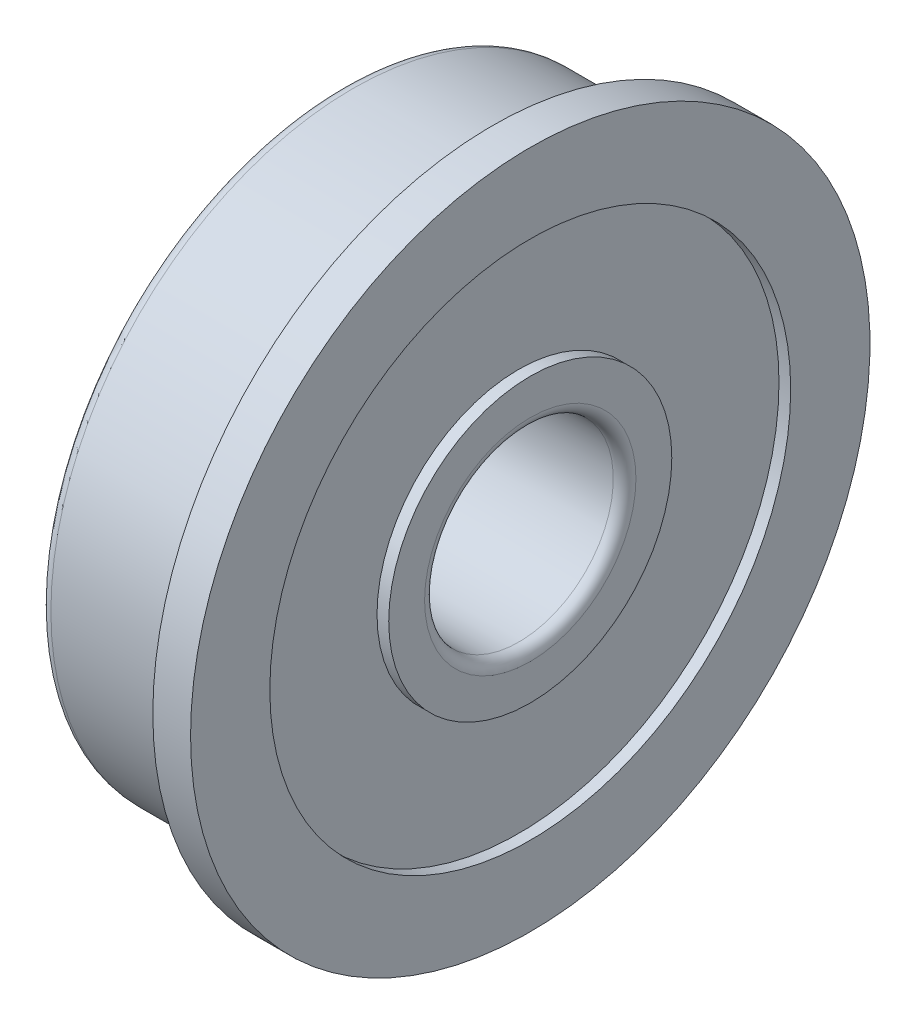
ISO-10303-21;
HEADER;
FILE_DESCRIPTION(('STEP AP214'),'2;1');
FILE_NAME('part.step','',(''),(''),'','','');
FILE_SCHEMA(('AUTOMOTIVE_DESIGN { 1 0 10303 214 1 1 1 1 }'));
ENDSEC;
DATA;
#1=APPLICATION_CONTEXT('core data for automotive mechanical design processes');
#2=APPLICATION_PROTOCOL_DEFINITION('international standard','automotive_design',2000,#1);
#3=PRODUCT_CONTEXT('',#1,'mechanical');
#4=PRODUCT('Part','Part','',(#3));
#5=PRODUCT_RELATED_PRODUCT_CATEGORY('part','',(#4));
#6=PRODUCT_DEFINITION_FORMATION('','',#4);
#7=PRODUCT_DEFINITION_CONTEXT('part definition',#1,'design');
#8=PRODUCT_DEFINITION('design','',#6,#7);
#9=PRODUCT_DEFINITION_SHAPE('','',#8);
#10=(LENGTH_UNIT() NAMED_UNIT(*) SI_UNIT(.MILLI.,.METRE.));
#11=(NAMED_UNIT(*) PLANE_ANGLE_UNIT() SI_UNIT($,.RADIAN.));
#12=(NAMED_UNIT(*) SI_UNIT($,.STERADIAN.) SOLID_ANGLE_UNIT());
#13=UNCERTAINTY_MEASURE_WITH_UNIT(LENGTH_MEASURE(1.E-05),#10,'distance_accuracy_value','');
#14=(GEOMETRIC_REPRESENTATION_CONTEXT(3) GLOBAL_UNCERTAINTY_ASSIGNED_CONTEXT((#13)) GLOBAL_UNIT_ASSIGNED_CONTEXT((#10,
#11,#12)) REPRESENTATION_CONTEXT('',''));
#15=CARTESIAN_POINT('',(0.,0.,0.));
#16=DIRECTION('',(0.,0.,1.));
#17=DIRECTION('',(1.,0.,0.));
#18=AXIS2_PLACEMENT_3D('',#15,#16,#17);
#19=CARTESIAN_POINT('',(-4.,0.,0.));
#20=DIRECTION('',(-1.,0.,0.));
#21=DIRECTION('',(0.,0.,1.));
#22=AXIS2_PLACEMENT_3D('',#19,#20,#21);
#23=CYLINDRICAL_SURFACE('',#22,9.);
#24=CARTESIAN_POINT('',(0.,0.,0.));
#25=DIRECTION('',(-1.,0.,0.));
#26=DIRECTION('',(0.,0.,1.));
#27=AXIS2_PLACEMENT_3D('',#24,#25,#26);
#28=CIRCLE('',#27,9.);
#29=CARTESIAN_POINT('',(0.,0.,9.));
#30=VERTEX_POINT('',#29);
#31=EDGE_CURVE('E57',#30,#30,#28,.T.);
#32=ORIENTED_EDGE('',*,*,#31,.F.);
#33=EDGE_LOOP('',(#32));
#34=FACE_BOUND('',#33,.T.);
#35=CARTESIAN_POINT('',(0.999999999999999,0.,0.));
#36=DIRECTION('',(-1.,0.,0.));
#37=DIRECTION('',(0.,0.,1.));
#38=AXIS2_PLACEMENT_3D('',#35,#36,#37);
#39=CIRCLE('',#38,9.);
#40=CARTESIAN_POINT('',(0.999999999999999,0.,9.));
#41=VERTEX_POINT('',#40);
#42=EDGE_CURVE('E90',#41,#41,#39,.T.);
#43=ORIENTED_EDGE('',*,*,#42,.T.);
#44=EDGE_LOOP('',(#43));
#45=FACE_BOUND('',#44,.T.);
#46=ADVANCED_FACE('F31',(#34,#45),#23,.T.);
#47=CARTESIAN_POINT('',(0.,8.2,0.));
#48=DIRECTION('',(1.,0.,0.));
#49=DIRECTION('',(0.,0.,-1.));
#50=AXIS2_PLACEMENT_3D('',#47,#48,#49);
#51=PLANE('',#50);
#52=CARTESIAN_POINT('',(0.,0.,0.));
#53=DIRECTION('',(-1.,0.,0.));
#54=DIRECTION('',(0.,0.,1.));
#55=AXIS2_PLACEMENT_3D('',#52,#53,#54);
#56=CIRCLE('',#55,8.2);
#57=CARTESIAN_POINT('',(0.,0.,8.2));
#58=VERTEX_POINT('',#57);
#59=EDGE_CURVE('E60',#58,#58,#56,.T.);
#60=ORIENTED_EDGE('',*,*,#59,.F.);
#61=EDGE_LOOP('',(#60));
#62=FACE_BOUND('',#61,.T.);
#63=ORIENTED_EDGE('',*,*,#31,.T.);
#64=EDGE_LOOP('',(#63));
#65=FACE_BOUND('',#64,.T.);
#66=ADVANCED_FACE('F132',(#62,#65),#51,.F.);
#67=CARTESIAN_POINT('',(0.,0.,0.));
#68=DIRECTION('',(-1.,0.,0.));
#69=DIRECTION('',(0.,0.,1.));
#70=AXIS2_PLACEMENT_3D('',#67,#68,#69);
#71=TOROIDAL_SURFACE('',#70,8.,0.200000000000001);
#72=CARTESIAN_POINT('',(-0.200000000000001,0.,0.));
#73=DIRECTION('',(-1.,0.,0.));
#74=DIRECTION('',(0.,0.,1.));
#75=AXIS2_PLACEMENT_3D('',#72,#73,#74);
#76=CIRCLE('',#75,8.);
#77=CARTESIAN_POINT('',(-0.200000000000001,0.,8.));
#78=VERTEX_POINT('',#77);
#79=EDGE_CURVE('E63',#78,#78,#76,.T.);
#80=ORIENTED_EDGE('',*,*,#79,.F.);
#81=EDGE_LOOP('',(#80));
#82=FACE_BOUND('',#81,.T.);
#83=ORIENTED_EDGE('',*,*,#59,.T.);
#84=EDGE_LOOP('',(#83));
#85=FACE_BOUND('',#84,.T.);
#86=ADVANCED_FACE('F138',(#82,#85),#71,.F.);
#87=CARTESIAN_POINT('',(-4.,0.,0.));
#88=DIRECTION('',(-1.,0.,0.));
#89=DIRECTION('',(0.,0.,1.));
#90=AXIS2_PLACEMENT_3D('',#87,#88,#89);
#91=CYLINDRICAL_SURFACE('',#90,8.);
#92=CARTESIAN_POINT('',(-3.7,0.,0.));
#93=DIRECTION('',(1.,0.,0.));
#94=DIRECTION('',(0.,0.,-1.));
#95=AXIS2_PLACEMENT_3D('',#92,#93,#94);
#96=CIRCLE('',#95,8.);
#97=CARTESIAN_POINT('',(-3.7,0.,-8.));
#98=VERTEX_POINT('',#97);
#99=EDGE_CURVE('E10',#98,#98,#96,.T.);
#100=ORIENTED_EDGE('',*,*,#99,.T.);
#101=EDGE_LOOP('',(#100));
#102=FACE_BOUND('',#101,.T.);
#103=ORIENTED_EDGE('',*,*,#79,.T.);
#104=EDGE_LOOP('',(#103));
#105=FACE_BOUND('',#104,.T.);
#106=ADVANCED_FACE('F183',(#102,#105),#91,.T.);
#107=CARTESIAN_POINT('',(-4.,6.9,0.));
#108=DIRECTION('',(1.,0.,0.));
#109=DIRECTION('',(0.,0.,-1.));
#110=AXIS2_PLACEMENT_3D('',#107,#108,#109);
#111=PLANE('',#110);
#112=CARTESIAN_POINT('',(-4.,0.,0.));
#113=DIRECTION('',(1.,0.,0.));
#114=DIRECTION('',(0.,0.,-1.));
#115=AXIS2_PLACEMENT_3D('',#112,#113,#114);
#116=CIRCLE('',#115,7.7);
#117=CARTESIAN_POINT('',(-4.,0.,-7.7));
#118=VERTEX_POINT('',#117);
#119=EDGE_CURVE('E38',#118,#118,#116,.F.);
#120=ORIENTED_EDGE('',*,*,#119,.T.);
#121=EDGE_LOOP('',(#120));
#122=FACE_BOUND('',#121,.T.);
#123=CARTESIAN_POINT('',(-4.,0.,0.));
#124=DIRECTION('',(-1.,0.,0.));
#125=DIRECTION('',(0.,0.,1.));
#126=AXIS2_PLACEMENT_3D('',#123,#124,#125);
#127=CIRCLE('',#126,6.9);
#128=CARTESIAN_POINT('',(-4.,0.,6.9));
#129=VERTEX_POINT('',#128);
#130=EDGE_CURVE('E66',#129,#129,#127,.T.);
#131=ORIENTED_EDGE('',*,*,#130,.F.);
#132=EDGE_LOOP('',(#131));
#133=FACE_BOUND('',#132,.T.);
#134=ADVANCED_FACE('F178',(#122,#133),#111,.F.);
#135=CARTESIAN_POINT('',(-4.,0.,0.));
#136=DIRECTION('',(-1.,0.,0.));
#137=DIRECTION('',(0.,0.,1.));
#138=AXIS2_PLACEMENT_3D('',#135,#136,#137);
#139=CYLINDRICAL_SURFACE('',#138,6.9);
#140=CARTESIAN_POINT('',(-3.69,0.,0.));
#141=DIRECTION('',(-1.,0.,0.));
#142=DIRECTION('',(0.,0.,1.));
#143=AXIS2_PLACEMENT_3D('',#140,#141,#142);
#144=CIRCLE('',#143,6.9);
#145=CARTESIAN_POINT('',(-3.69,0.,6.9));
#146=VERTEX_POINT('',#145);
#147=EDGE_CURVE('E69',#146,#146,#144,.T.);
#148=ORIENTED_EDGE('',*,*,#147,.F.);
#149=EDGE_LOOP('',(#148));
#150=FACE_BOUND('',#149,.T.);
#151=ORIENTED_EDGE('',*,*,#130,.T.);
#152=EDGE_LOOP('',(#151));
#153=FACE_BOUND('',#152,.T.);
#154=ADVANCED_FACE('F172',(#150,#153),#139,.F.);
#155=CARTESIAN_POINT('',(-3.69,6.9,0.));
#156=DIRECTION('',(1.,0.,0.));
#157=DIRECTION('',(0.,0.,-1.));
#158=AXIS2_PLACEMENT_3D('',#155,#156,#157);
#159=PLANE('',#158);
#160=CARTESIAN_POINT('',(-3.69,0.,0.));
#161=DIRECTION('',(-1.,0.,0.));
#162=DIRECTION('',(0.,0.,1.));
#163=AXIS2_PLACEMENT_3D('',#160,#161,#162);
#164=CIRCLE('',#163,3.75);
#165=CARTESIAN_POINT('',(-3.69,0.,3.75));
#166=VERTEX_POINT('',#165);
#167=EDGE_CURVE('E72',#166,#166,#164,.T.);
#168=ORIENTED_EDGE('',*,*,#167,.F.);
#169=EDGE_LOOP('',(#168));
#170=FACE_BOUND('',#169,.T.);
#171=ORIENTED_EDGE('',*,*,#147,.T.);
#172=EDGE_LOOP('',(#171));
#173=FACE_BOUND('',#172,.T.);
#174=ADVANCED_FACE('F166',(#170,#173),#159,.F.);
#175=CARTESIAN_POINT('',(-4.,0.,0.));
#176=DIRECTION('',(-1.,0.,0.));
#177=DIRECTION('',(0.,0.,1.));
#178=AXIS2_PLACEMENT_3D('',#175,#176,#177);
#179=CYLINDRICAL_SURFACE('',#178,3.75);
#180=CARTESIAN_POINT('',(-4.,0.,0.));
#181=DIRECTION('',(-1.,0.,0.));
#182=DIRECTION('',(0.,0.,1.));
#183=AXIS2_PLACEMENT_3D('',#180,#181,#182);
#184=CIRCLE('',#183,3.75);
#185=CARTESIAN_POINT('',(-4.,0.,3.75));
#186=VERTEX_POINT('',#185);
#187=EDGE_CURVE('E75',#186,#186,#184,.T.);
#188=ORIENTED_EDGE('',*,*,#187,.F.);
#189=EDGE_LOOP('',(#188));
#190=FACE_BOUND('',#189,.T.);
#191=ORIENTED_EDGE('',*,*,#167,.T.);
#192=EDGE_LOOP('',(#191));
#193=FACE_BOUND('',#192,.T.);
#194=ADVANCED_FACE('F160',(#190,#193),#179,.T.);
#195=CARTESIAN_POINT('',(-4.,2.5,0.));
#196=DIRECTION('',(1.,0.,0.));
#197=DIRECTION('',(0.,0.,-1.));
#198=AXIS2_PLACEMENT_3D('',#195,#196,#197);
#199=PLANE('',#198);
#200=CARTESIAN_POINT('',(-4.,0.,0.));
#201=DIRECTION('',(1.,0.,0.));
#202=DIRECTION('',(0.,0.,-1.));
#203=AXIS2_PLACEMENT_3D('',#200,#201,#202);
#204=CIRCLE('',#203,2.8);
#205=CARTESIAN_POINT('',(-4.,0.,-2.8));
#206=VERTEX_POINT('',#205);
#207=EDGE_CURVE('E42',#206,#206,#204,.T.);
#208=ORIENTED_EDGE('',*,*,#207,.T.);
#209=EDGE_LOOP('',(#208));
#210=FACE_BOUND('',#209,.T.);
#211=ORIENTED_EDGE('',*,*,#187,.T.);
#212=EDGE_LOOP('',(#211));
#213=FACE_BOUND('',#212,.T.);
#214=ADVANCED_FACE('F128',(#210,#213),#199,.F.);
#215=CARTESIAN_POINT('',(-4.,0.,0.));
#216=DIRECTION('',(-1.,0.,0.));
#217=DIRECTION('',(0.,0.,1.));
#218=AXIS2_PLACEMENT_3D('',#215,#216,#217);
#219=CYLINDRICAL_SURFACE('',#218,2.5);
#220=CARTESIAN_POINT('',(0.7,0.,0.));
#221=DIRECTION('',(-1.,0.,0.));
#222=DIRECTION('',(0.,0.,1.));
#223=AXIS2_PLACEMENT_3D('',#220,#221,#222);
#224=CIRCLE('',#223,2.5);
#225=CARTESIAN_POINT('',(0.7,0.,2.5));
#226=VERTEX_POINT('',#225);
#227=EDGE_CURVE('E46',#226,#226,#224,.F.);
#228=ORIENTED_EDGE('',*,*,#227,.T.);
#229=EDGE_LOOP('',(#228));
#230=FACE_BOUND('',#229,.T.);
#231=CARTESIAN_POINT('',(-3.7,0.,0.));
#232=DIRECTION('',(1.,0.,0.));
#233=DIRECTION('',(0.,0.,-1.));
#234=AXIS2_PLACEMENT_3D('',#231,#232,#233);
#235=CIRCLE('',#234,2.5);
#236=CARTESIAN_POINT('',(-3.7,0.,-2.5));
#237=VERTEX_POINT('',#236);
#238=EDGE_CURVE('E51',#237,#237,#235,.F.);
#239=ORIENTED_EDGE('',*,*,#238,.T.);
#240=EDGE_LOOP('',(#239));
#241=FACE_BOUND('',#240,.T.);
#242=ADVANCED_FACE('F122',(#230,#241),#219,.F.);
#243=CARTESIAN_POINT('',(1.,3.75,0.));
#244=DIRECTION('',(-1.,0.,0.));
#245=DIRECTION('',(0.,0.,1.));
#246=AXIS2_PLACEMENT_3D('',#243,#244,#245);
#247=PLANE('',#246);
#248=CARTESIAN_POINT('',(1.,0.,0.));
#249=DIRECTION('',(-1.,0.,0.));
#250=DIRECTION('',(0.,0.,1.));
#251=AXIS2_PLACEMENT_3D('',#248,#249,#250);
#252=CIRCLE('',#251,2.8);
#253=CARTESIAN_POINT('',(1.,0.,2.8));
#254=VERTEX_POINT('',#253);
#255=EDGE_CURVE('E54',#254,#254,#252,.T.);
#256=ORIENTED_EDGE('',*,*,#255,.T.);
#257=EDGE_LOOP('',(#256));
#258=FACE_BOUND('',#257,.T.);
#259=CARTESIAN_POINT('',(1.,0.,0.));
#260=DIRECTION('',(-1.,0.,0.));
#261=DIRECTION('',(0.,0.,1.));
#262=AXIS2_PLACEMENT_3D('',#259,#260,#261);
#263=CIRCLE('',#262,3.75);
#264=CARTESIAN_POINT('',(1.,0.,3.75));
#265=VERTEX_POINT('',#264);
#266=EDGE_CURVE('E78',#265,#265,#263,.T.);
#267=ORIENTED_EDGE('',*,*,#266,.F.);
#268=EDGE_LOOP('',(#267));
#269=FACE_BOUND('',#268,.T.);
#270=ADVANCED_FACE('F117',(#258,#269),#247,.F.);
#271=CARTESIAN_POINT('',(-4.,0.,0.));
#272=DIRECTION('',(-1.,0.,0.));
#273=DIRECTION('',(0.,0.,1.));
#274=AXIS2_PLACEMENT_3D('',#271,#272,#273);
#275=CYLINDRICAL_SURFACE('',#274,3.75);
#276=CARTESIAN_POINT('',(0.69,0.,0.));
#277=DIRECTION('',(-1.,0.,0.));
#278=DIRECTION('',(0.,0.,1.));
#279=AXIS2_PLACEMENT_3D('',#276,#277,#278);
#280=CIRCLE('',#279,3.75);
#281=CARTESIAN_POINT('',(0.69,0.,3.75));
#282=VERTEX_POINT('',#281);
#283=EDGE_CURVE('E81',#282,#282,#280,.T.);
#284=ORIENTED_EDGE('',*,*,#283,.F.);
#285=EDGE_LOOP('',(#284));
#286=FACE_BOUND('',#285,.T.);
#287=ORIENTED_EDGE('',*,*,#266,.T.);
#288=EDGE_LOOP('',(#287));
#289=FACE_BOUND('',#288,.T.);
#290=ADVANCED_FACE('F111',(#286,#289),#275,.T.);
#291=CARTESIAN_POINT('',(0.689999999999999,6.9,0.));
#292=DIRECTION('',(-1.,0.,0.));
#293=DIRECTION('',(0.,0.,1.));
#294=AXIS2_PLACEMENT_3D('',#291,#292,#293);
#295=PLANE('',#294);
#296=CARTESIAN_POINT('',(0.69,0.,0.));
#297=DIRECTION('',(-1.,0.,0.));
#298=DIRECTION('',(0.,0.,1.));
#299=AXIS2_PLACEMENT_3D('',#296,#297,#298);
#300=CIRCLE('',#299,6.9);
#301=CARTESIAN_POINT('',(0.69,0.,6.9));
#302=VERTEX_POINT('',#301);
#303=EDGE_CURVE('E84',#302,#302,#300,.T.);
#304=ORIENTED_EDGE('',*,*,#303,.F.);
#305=EDGE_LOOP('',(#304));
#306=FACE_BOUND('',#305,.T.);
#307=ORIENTED_EDGE('',*,*,#283,.T.);
#308=EDGE_LOOP('',(#307));
#309=FACE_BOUND('',#308,.T.);
#310=ADVANCED_FACE('F105',(#306,#309),#295,.F.);
#311=CARTESIAN_POINT('',(-4.,0.,0.));
#312=DIRECTION('',(-1.,0.,0.));
#313=DIRECTION('',(0.,0.,1.));
#314=AXIS2_PLACEMENT_3D('',#311,#312,#313);
#315=CYLINDRICAL_SURFACE('',#314,6.9);
#316=CARTESIAN_POINT('',(0.999999999999999,0.,0.));
#317=DIRECTION('',(-1.,0.,0.));
#318=DIRECTION('',(0.,0.,1.));
#319=AXIS2_PLACEMENT_3D('',#316,#317,#318);
#320=CIRCLE('',#319,6.9);
#321=CARTESIAN_POINT('',(0.999999999999999,0.,6.9));
#322=VERTEX_POINT('',#321);
#323=EDGE_CURVE('E87',#322,#322,#320,.T.);
#324=ORIENTED_EDGE('',*,*,#323,.F.);
#325=EDGE_LOOP('',(#324));
#326=FACE_BOUND('',#325,.T.);
#327=ORIENTED_EDGE('',*,*,#303,.T.);
#328=EDGE_LOOP('',(#327));
#329=FACE_BOUND('',#328,.T.);
#330=ADVANCED_FACE('F99',(#326,#329),#315,.F.);
#331=CARTESIAN_POINT('',(1.,9.,0.));
#332=DIRECTION('',(-1.,0.,0.));
#333=DIRECTION('',(0.,0.,1.));
#334=AXIS2_PLACEMENT_3D('',#331,#332,#333);
#335=PLANE('',#334);
#336=ORIENTED_EDGE('',*,*,#42,.F.);
#337=EDGE_LOOP('',(#336));
#338=FACE_BOUND('',#337,.T.);
#339=ORIENTED_EDGE('',*,*,#323,.T.);
#340=EDGE_LOOP('',(#339));
#341=FACE_BOUND('',#340,.T.);
#342=ADVANCED_FACE('F95',(#338,#341),#335,.F.);
#343=CARTESIAN_POINT('',(0.7,0.,0.));
#344=DIRECTION('',(-1.,0.,0.));
#345=DIRECTION('',(0.,0.,1.));
#346=AXIS2_PLACEMENT_3D('',#343,#344,#345);
#347=TOROIDAL_SURFACE('',#346,2.8,0.3);
#348=ORIENTED_EDGE('',*,*,#227,.F.);
#349=EDGE_LOOP('',(#348));
#350=FACE_BOUND('',#349,.T.);
#351=ORIENTED_EDGE('',*,*,#255,.F.);
#352=EDGE_LOOP('',(#351));
#353=FACE_BOUND('',#352,.T.);
#354=ADVANCED_FACE('F98',(#350,#353),#347,.T.);
#355=CARTESIAN_POINT('',(-3.7,0.,0.));
#356=DIRECTION('',(1.,0.,0.));
#357=DIRECTION('',(0.,0.,-1.));
#358=AXIS2_PLACEMENT_3D('',#355,#356,#357);
#359=TOROIDAL_SURFACE('',#358,2.8,0.3);
#360=ORIENTED_EDGE('',*,*,#207,.F.);
#361=EDGE_LOOP('',(#360));
#362=FACE_BOUND('',#361,.T.);
#363=ORIENTED_EDGE('',*,*,#238,.F.);
#364=EDGE_LOOP('',(#363));
#365=FACE_BOUND('',#364,.T.);
#366=ADVANCED_FACE('F145',(#362,#365),#359,.T.);
#367=CARTESIAN_POINT('',(-3.7,0.,0.));
#368=DIRECTION('',(1.,0.,0.));
#369=DIRECTION('',(0.,0.,-1.));
#370=AXIS2_PLACEMENT_3D('',#367,#368,#369);
#371=TOROIDAL_SURFACE('',#370,7.7,0.3);
#372=ORIENTED_EDGE('',*,*,#99,.F.);
#373=EDGE_LOOP('',(#372));
#374=FACE_BOUND('',#373,.T.);
#375=ORIENTED_EDGE('',*,*,#119,.F.);
#376=EDGE_LOOP('',(#375));
#377=FACE_BOUND('',#376,.T.);
#378=ADVANCED_FACE('F33',(#374,#377),#371,.T.);
#379=CLOSED_SHELL('',(#46,#66,#86,#106,#134,#154,#174,#194,#214,#242,#270,#290,#310,#330,#342,
#354,#366,#378));
#380=MANIFOLD_SOLID_BREP('B2',#379);
#381=ADVANCED_BREP_SHAPE_REPRESENTATION('',(#18,#380),#14);
#382=SHAPE_DEFINITION_REPRESENTATION(#9,#381);
ENDSEC;
END-ISO-10303-21;
